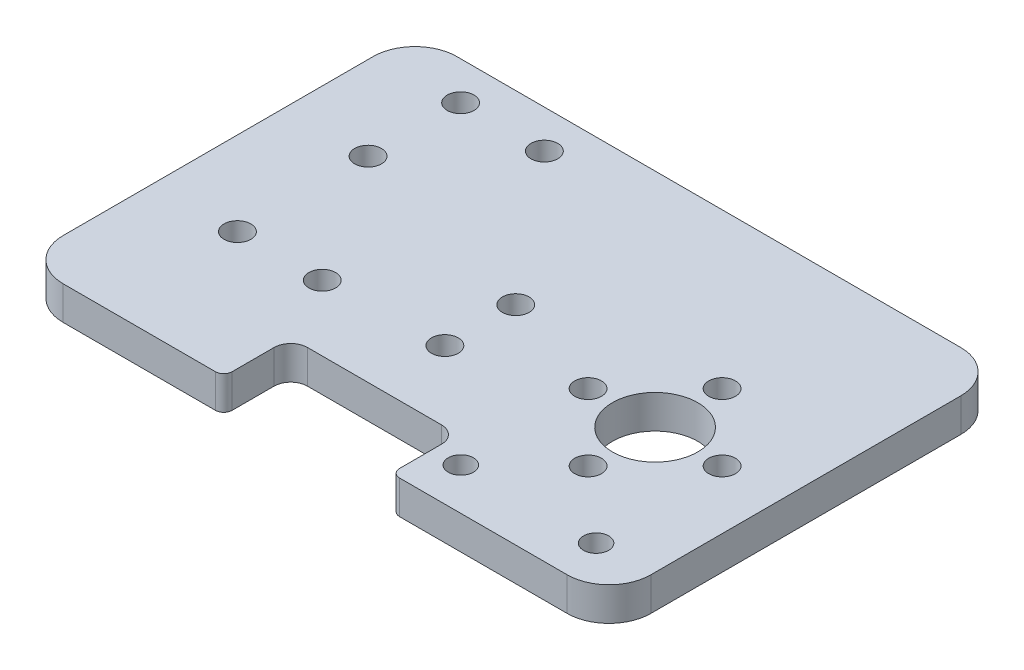
ISO-10303-21;
HEADER;
FILE_DESCRIPTION(('STEP AP214'),'2;1');
FILE_NAME('part.step','',(''),(''),'','','');
FILE_SCHEMA(('AUTOMOTIVE_DESIGN { 1 0 10303 214 1 1 1 1 }'));
ENDSEC;
DATA;
#1=APPLICATION_CONTEXT('core data for automotive mechanical design processes');
#2=APPLICATION_PROTOCOL_DEFINITION('international standard','automotive_design',2000,#1);
#3=PRODUCT_CONTEXT('',#1,'mechanical');
#4=PRODUCT('Part','Part','',(#3));
#5=PRODUCT_RELATED_PRODUCT_CATEGORY('part','',(#4));
#6=PRODUCT_DEFINITION_FORMATION('','',#4);
#7=PRODUCT_DEFINITION_CONTEXT('part definition',#1,'design');
#8=PRODUCT_DEFINITION('design','',#6,#7);
#9=PRODUCT_DEFINITION_SHAPE('','',#8);
#10=(LENGTH_UNIT() NAMED_UNIT(*) SI_UNIT(.MILLI.,.METRE.));
#11=(NAMED_UNIT(*) PLANE_ANGLE_UNIT() SI_UNIT($,.RADIAN.));
#12=(NAMED_UNIT(*) SI_UNIT($,.STERADIAN.) SOLID_ANGLE_UNIT());
#13=UNCERTAINTY_MEASURE_WITH_UNIT(LENGTH_MEASURE(1.E-05),#10,'distance_accuracy_value','');
#14=(GEOMETRIC_REPRESENTATION_CONTEXT(3) GLOBAL_UNCERTAINTY_ASSIGNED_CONTEXT((#13)) GLOBAL_UNIT_ASSIGNED_CONTEXT((#10,
#11,#12)) REPRESENTATION_CONTEXT('',''));
#15=CARTESIAN_POINT('',(0.,0.,0.));
#16=DIRECTION('',(0.,0.,1.));
#17=DIRECTION('',(1.,0.,0.));
#18=AXIS2_PLACEMENT_3D('',#15,#16,#17);
#19=CARTESIAN_POINT('',(69.9999999999753,74.7441308476182,25.5000000046335));
#20=DIRECTION('',(0.,0.,1.));
#21=DIRECTION('',(1.,0.,0.));
#22=AXIS2_PLACEMENT_3D('',#19,#20,#21);
#23=PLANE('',#22);
#24=DIRECTION('',(1.,0.,0.));
#25=VECTOR('',#24,1.);
#26=CARTESIAN_POINT('',(69.9999999999753,4.,25.5000000046335));
#27=LINE('',#26,#25);
#28=CARTESIAN_POINT('',(45.,4.,25.5000000046335));
#29=VERTEX_POINT('',#28);
#30=CARTESIAN_POINT('',(65.,4.,25.5000000046335));
#31=VERTEX_POINT('',#30);
#32=EDGE_CURVE('E252',#29,#31,#27,.T.);
#33=ORIENTED_EDGE('',*,*,#32,.F.);
#34=DIRECTION('',(0.,-1.,0.));
#35=VECTOR('',#34,1.);
#36=CARTESIAN_POINT('',(45.,0.,25.5000000046335));
#37=LINE('',#36,#35);
#38=CARTESIAN_POINT('',(45.,0.,25.5000000046335));
#39=VERTEX_POINT('',#38);
#40=EDGE_CURVE('E339',#29,#39,#37,.T.);
#41=ORIENTED_EDGE('',*,*,#40,.T.);
#42=DIRECTION('',(-1.,0.,0.));
#43=VECTOR('',#42,1.);
#44=CARTESIAN_POINT('',(69.9999999999753,0.,25.5000000046335));
#45=LINE('',#44,#43);
#46=CARTESIAN_POINT('',(65.,0.,25.5000000046335));
#47=VERTEX_POINT('',#46);
#48=EDGE_CURVE('E253',#47,#39,#45,.T.);
#49=ORIENTED_EDGE('',*,*,#48,.F.);
#50=DIRECTION('',(0.,-1.,0.));
#51=VECTOR('',#50,1.);
#52=CARTESIAN_POINT('',(65.,4.,25.5000000046335));
#53=LINE('',#52,#51);
#54=EDGE_CURVE('E320',#47,#31,#53,.F.);
#55=ORIENTED_EDGE('',*,*,#54,.T.);
#56=EDGE_LOOP('',(#33,#41,#49,#55));
#57=FACE_BOUND('',#56,.T.);
#58=ADVANCED_FACE('F34',(#57),#23,.T.);
#59=CARTESIAN_POINT('',(-90.,4.,-21.5));
#60=DIRECTION('',(0.,0.,1.));
#61=DIRECTION('',(1.,0.,0.));
#62=AXIS2_PLACEMENT_3D('',#59,#60,#61);
#63=PLANE('',#62);
#64=DIRECTION('',(-1.,0.,0.));
#65=VECTOR('',#64,1.);
#66=CARTESIAN_POINT('',(-90.,0.,-21.5));
#67=LINE('',#66,#65);
#68=CARTESIAN_POINT('',(64.9999999999999,0.,-21.5));
#69=VERTEX_POINT('',#68);
#70=CARTESIAN_POINT('',(4.83069011810414,0.,-21.5));
#71=VERTEX_POINT('',#70);
#72=EDGE_CURVE('E293',#69,#71,#67,.T.);
#73=ORIENTED_EDGE('',*,*,#72,.T.);
#74=DIRECTION('',(0.,-1.,0.));
#75=VECTOR('',#74,1.);
#76=CARTESIAN_POINT('',(4.83069011810417,4.,-21.5));
#77=LINE('',#76,#75);
#78=CARTESIAN_POINT('',(4.83069011810414,4.,-21.5));
#79=VERTEX_POINT('',#78);
#80=EDGE_CURVE('E315',#71,#79,#77,.F.);
#81=ORIENTED_EDGE('',*,*,#80,.T.);
#82=DIRECTION('',(-1.,0.,0.));
#83=VECTOR('',#82,1.);
#84=CARTESIAN_POINT('',(-90.,4.,-21.5));
#85=LINE('',#84,#83);
#86=CARTESIAN_POINT('',(64.9999999999999,4.,-21.5));
#87=VERTEX_POINT('',#86);
#88=EDGE_CURVE('E296',#87,#79,#85,.T.);
#89=ORIENTED_EDGE('',*,*,#88,.F.);
#90=DIRECTION('',(0.,1.,0.));
#91=VECTOR('',#90,1.);
#92=CARTESIAN_POINT('',(65.,4.,-21.5));
#93=LINE('',#92,#91);
#94=EDGE_CURVE('E308',#87,#69,#93,.F.);
#95=ORIENTED_EDGE('',*,*,#94,.T.);
#96=EDGE_LOOP('',(#73,#81,#89,#95));
#97=FACE_BOUND('',#96,.T.);
#98=ADVANCED_FACE('F390',(#97),#63,.F.);
#99=CARTESIAN_POINT('',(0.,4.,0.));
#100=DIRECTION('',(0.,-1.,0.));
#101=DIRECTION('',(0.,0.,-1.));
#102=AXIS2_PLACEMENT_3D('',#99,#100,#101);
#103=PLANE('',#102);
#104=CARTESIAN_POINT('',(19.9250913739891,4.,9.66419342931644));
#105=DIRECTION('',(0.,1.,0.));
#106=DIRECTION('',(0.,0.,1.));
#107=AXIS2_PLACEMENT_3D('',#104,#105,#106);
#108=CIRCLE('',#107,1.6);
#109=CARTESIAN_POINT('',(19.9250913739891,4.,11.2641934293164));
#110=VERTEX_POINT('',#109);
#111=EDGE_CURVE('E191',#110,#110,#108,.T.);
#112=ORIENTED_EDGE('',*,*,#111,.F.);
#113=EDGE_LOOP('',(#112));
#114=FACE_BOUND('',#113,.T.);
#115=CARTESIAN_POINT('',(19.8306901181041,4.,-16.9489152181335));
#116=DIRECTION('',(0.,-1.,0.));
#117=DIRECTION('',(0.,0.,-1.));
#118=AXIS2_PLACEMENT_3D('',#115,#116,#117);
#119=CIRCLE('',#118,1.6);
#120=CARTESIAN_POINT('',(19.8306901181041,4.,-18.5489152181335));
#121=VERTEX_POINT('',#120);
#122=EDGE_CURVE('E214',#121,#121,#119,.T.);
#123=ORIENTED_EDGE('',*,*,#122,.T.);
#124=EDGE_LOOP('',(#123));
#125=FACE_BOUND('',#124,.T.);
#126=CARTESIAN_POINT('',(9.83069011810414,4.,-16.9489152181335));
#127=DIRECTION('',(0.,-1.,0.));
#128=DIRECTION('',(0.,0.,-1.));
#129=AXIS2_PLACEMENT_3D('',#126,#127,#128);
#130=CIRCLE('',#129,1.6);
#131=CARTESIAN_POINT('',(9.83069011810414,4.,-18.5489152181335));
#132=VERTEX_POINT('',#131);
#133=EDGE_CURVE('E208',#132,#132,#130,.T.);
#134=ORIENTED_EDGE('',*,*,#133,.T.);
#135=EDGE_LOOP('',(#134));
#136=FACE_BOUND('',#135,.T.);
#137=CARTESIAN_POINT('',(9.83069011810414,4.,9.7));
#138=DIRECTION('',(0.,-1.,0.));
#139=DIRECTION('',(0.,0.,-1.));
#140=AXIS2_PLACEMENT_3D('',#137,#138,#139);
#141=CIRCLE('',#140,1.6);
#142=CARTESIAN_POINT('',(9.83069011810414,4.,8.1));
#143=VERTEX_POINT('',#142);
#144=EDGE_CURVE('E201',#143,#143,#141,.T.);
#145=ORIENTED_EDGE('',*,*,#144,.T.);
#146=EDGE_LOOP('',(#145));
#147=FACE_BOUND('',#146,.T.);
#148=CARTESIAN_POINT('',(9.83069011810414,4.,-5.9));
#149=DIRECTION('',(0.,-1.,0.));
#150=DIRECTION('',(0.,0.,-1.));
#151=AXIS2_PLACEMENT_3D('',#148,#149,#150);
#152=CIRCLE('',#151,1.6);
#153=CARTESIAN_POINT('',(9.83069011810414,4.,-7.5));
#154=VERTEX_POINT('',#153);
#155=EDGE_CURVE('E219',#154,#154,#152,.T.);
#156=ORIENTED_EDGE('',*,*,#155,.T.);
#157=EDGE_LOOP('',(#156));
#158=FACE_BOUND('',#157,.T.);
#159=CARTESIAN_POINT('',(33.9999999999993,4.,0.636740590504687));
#160=DIRECTION('',(0.,-1.,0.));
#161=DIRECTION('',(0.,0.,-1.));
#162=AXIS2_PLACEMENT_3D('',#159,#160,#161);
#163=CIRCLE('',#162,1.60000000001061);
#164=CARTESIAN_POINT('',(33.9999999999993,4.,-0.963259409505926));
#165=VERTEX_POINT('',#164);
#166=EDGE_CURVE('E225',#165,#165,#163,.T.);
#167=ORIENTED_EDGE('',*,*,#166,.T.);
#168=EDGE_LOOP('',(#167));
#169=FACE_BOUND('',#168,.T.);
#170=CARTESIAN_POINT('',(33.9999999999817,4.,9.09999999998512));
#171=DIRECTION('',(0.,-1.,0.));
#172=DIRECTION('',(0.,0.,-1.));
#173=AXIS2_PLACEMENT_3D('',#170,#171,#172);
#174=CIRCLE('',#173,1.5999999999967);
#175=CARTESIAN_POINT('',(33.9999999999817,4.,7.49999999998841));
#176=VERTEX_POINT('',#175);
#177=EDGE_CURVE('E232',#176,#176,#174,.T.);
#178=ORIENTED_EDGE('',*,*,#177,.T.);
#179=EDGE_LOOP('',(#178));
#180=FACE_BOUND('',#179,.T.);
#181=CARTESIAN_POINT('',(63.4553938665241,4.,20.4999999999989));
#182=DIRECTION('',(0.,-1.,0.));
#183=DIRECTION('',(0.,0.,-1.));
#184=AXIS2_PLACEMENT_3D('',#181,#182,#183);
#185=CIRCLE('',#184,1.5000000011415);
#186=CARTESIAN_POINT('',(63.4553938665241,4.,18.9999999988574));
#187=VERTEX_POINT('',#186);
#188=EDGE_CURVE('E237',#187,#187,#185,.T.);
#189=ORIENTED_EDGE('',*,*,#188,.T.);
#190=EDGE_LOOP('',(#189));
#191=FACE_BOUND('',#190,.T.);
#192=CARTESIAN_POINT('',(47.3014653528141,4.,20.4999999999993));
#193=DIRECTION('',(0.,-1.,0.));
#194=DIRECTION('',(0.,0.,-1.));
#195=AXIS2_PLACEMENT_3D('',#192,#193,#194);
#196=CIRCLE('',#195,1.50000000438096);
#197=CARTESIAN_POINT('',(47.3014653528141,4.,18.9999999956184));
#198=VERTEX_POINT('',#197);
#199=EDGE_CURVE('E244',#198,#198,#196,.T.);
#200=ORIENTED_EDGE('',*,*,#199,.T.);
#201=EDGE_LOOP('',(#200));
#202=FACE_BOUND('',#201,.T.);
#203=CARTESIAN_POINT('',(63.,4.,5.));
#204=DIRECTION('',(0.,1.,0.));
#205=DIRECTION('',(0.,0.,1.));
#206=AXIS2_PLACEMENT_3D('',#203,#204,#205);
#207=CIRCLE('',#206,1.60000000000001);
#208=CARTESIAN_POINT('',(63.,4.,6.6));
#209=VERTEX_POINT('',#208);
#210=EDGE_CURVE('E282',#209,#209,#207,.T.);
#211=ORIENTED_EDGE('',*,*,#210,.F.);
#212=EDGE_LOOP('',(#211));
#213=FACE_BOUND('',#212,.T.);
#214=CARTESIAN_POINT('',(55.,4.,13.));
#215=DIRECTION('',(0.,1.,0.));
#216=DIRECTION('',(0.,0.,1.));
#217=AXIS2_PLACEMENT_3D('',#214,#215,#216);
#218=CIRCLE('',#217,1.6);
#219=CARTESIAN_POINT('',(55.,4.,14.6));
#220=VERTEX_POINT('',#219);
#221=EDGE_CURVE('E269',#220,#220,#218,.T.);
#222=ORIENTED_EDGE('',*,*,#221,.F.);
#223=EDGE_LOOP('',(#222));
#224=FACE_BOUND('',#223,.T.);
#225=CARTESIAN_POINT('',(47.,4.,5.00000000000001));
#226=DIRECTION('',(0.,1.,0.));
#227=DIRECTION('',(0.,0.,1.));
#228=AXIS2_PLACEMENT_3D('',#225,#226,#227);
#229=CIRCLE('',#228,1.60000000000001);
#230=CARTESIAN_POINT('',(47.,4.,6.60000000000002));
#231=VERTEX_POINT('',#230);
#232=EDGE_CURVE('E270',#231,#231,#229,.T.);
#233=ORIENTED_EDGE('',*,*,#232,.F.);
#234=EDGE_LOOP('',(#233));
#235=FACE_BOUND('',#234,.T.);
#236=CARTESIAN_POINT('',(55.,4.,-3.));
#237=DIRECTION('',(0.,1.,0.));
#238=DIRECTION('',(0.,0.,1.));
#239=AXIS2_PLACEMENT_3D('',#236,#237,#238);
#240=CIRCLE('',#239,1.60000000000001);
#241=CARTESIAN_POINT('',(55.,4.,-1.39999999999999));
#242=VERTEX_POINT('',#241);
#243=EDGE_CURVE('E263',#242,#242,#240,.T.);
#244=ORIENTED_EDGE('',*,*,#243,.F.);
#245=EDGE_LOOP('',(#244));
#246=FACE_BOUND('',#245,.T.);
#247=CARTESIAN_POINT('',(55.,4.,5.));
#248=DIRECTION('',(0.,1.,0.));
#249=DIRECTION('',(0.,0.,1.));
#250=AXIS2_PLACEMENT_3D('',#247,#248,#249);
#251=CIRCLE('',#250,5.1);
#252=CARTESIAN_POINT('',(55.,4.,10.1));
#253=VERTEX_POINT('',#252);
#254=EDGE_CURVE('E281',#253,#253,#251,.T.);
#255=ORIENTED_EDGE('',*,*,#254,.F.);
#256=EDGE_LOOP('',(#255));
#257=FACE_BOUND('',#256,.T.);
#258=DIRECTION('',(0.,0.,1.));
#259=VECTOR('',#258,1.);
#260=CARTESIAN_POINT('',(44.,4.,25.5000000046335));
#261=LINE('',#260,#259);
#262=CARTESIAN_POINT('',(44.,4.,19.5000000046335));
#263=VERTEX_POINT('',#262);
#264=CARTESIAN_POINT('',(44.,4.,24.5000000046335));
#265=VERTEX_POINT('',#264);
#266=EDGE_CURVE('E166',#263,#265,#261,.T.);
#267=ORIENTED_EDGE('',*,*,#266,.T.);
#268=CARTESIAN_POINT('',(45.,4.,24.5000000046335));
#269=DIRECTION('',(0.,-1.,0.));
#270=DIRECTION('',(0.,0.,-1.));
#271=AXIS2_PLACEMENT_3D('',#268,#269,#270);
#272=CIRCLE('',#271,1.);
#273=EDGE_CURVE('E349',#265,#29,#272,.F.);
#274=ORIENTED_EDGE('',*,*,#273,.T.);
#275=ORIENTED_EDGE('',*,*,#32,.T.);
#276=CARTESIAN_POINT('',(65.,4.,20.5000000046335));
#277=DIRECTION('',(0.,-1.,0.));
#278=DIRECTION('',(0.,0.,-1.));
#279=AXIS2_PLACEMENT_3D('',#276,#277,#278);
#280=CIRCLE('',#279,5.);
#281=CARTESIAN_POINT('',(70.,4.,20.5000000046335));
#282=VERTEX_POINT('',#281);
#283=EDGE_CURVE('E332',#31,#282,#280,.F.);
#284=ORIENTED_EDGE('',*,*,#283,.T.);
#285=DIRECTION('',(0.,0.,1.));
#286=VECTOR('',#285,1.);
#287=CARTESIAN_POINT('',(70.,4.,-21.5));
#288=LINE('',#287,#286);
#289=CARTESIAN_POINT('',(70.,4.,-16.5));
#290=VERTEX_POINT('',#289);
#291=EDGE_CURVE('E258',#290,#282,#288,.T.);
#292=ORIENTED_EDGE('',*,*,#291,.F.);
#293=CARTESIAN_POINT('',(65.,4.,-16.5));
#294=DIRECTION('',(0.,-1.,0.));
#295=DIRECTION('',(0.,0.,-1.));
#296=AXIS2_PLACEMENT_3D('',#293,#294,#295);
#297=CIRCLE('',#296,5.);
#298=EDGE_CURVE('E299',#290,#87,#297,.F.);
#299=ORIENTED_EDGE('',*,*,#298,.T.);
#300=ORIENTED_EDGE('',*,*,#88,.T.);
#301=CARTESIAN_POINT('',(4.83069011810417,4.,-16.5));
#302=DIRECTION('',(0.,-1.,0.));
#303=DIRECTION('',(0.,0.,-1.));
#304=AXIS2_PLACEMENT_3D('',#301,#302,#303);
#305=CIRCLE('',#304,5.);
#306=CARTESIAN_POINT('',(-0.16930988189583,4.,-16.5));
#307=VERTEX_POINT('',#306);
#308=EDGE_CURVE('E317',#79,#307,#305,.F.);
#309=ORIENTED_EDGE('',*,*,#308,.T.);
#310=DIRECTION('',(0.,0.,-1.));
#311=VECTOR('',#310,1.);
#312=CARTESIAN_POINT('',(-0.16930988189583,4.,21.5));
#313=LINE('',#312,#311);
#314=CARTESIAN_POINT('',(-0.16930988189583,4.,20.5000000046335));
#315=VERTEX_POINT('',#314);
#316=EDGE_CURVE('E256',#315,#307,#313,.T.);
#317=ORIENTED_EDGE('',*,*,#316,.F.);
#318=CARTESIAN_POINT('',(4.83069011810416,4.,20.5000000046335));
#319=DIRECTION('',(0.,-1.,0.));
#320=DIRECTION('',(0.,0.,-1.));
#321=AXIS2_PLACEMENT_3D('',#318,#319,#320);
#322=CIRCLE('',#321,5.);
#323=CARTESIAN_POINT('',(4.83069011810416,4.,25.5000000046335));
#324=VERTEX_POINT('',#323);
#325=EDGE_CURVE('E334',#315,#324,#322,.F.);
#326=ORIENTED_EDGE('',*,*,#325,.T.);
#327=CARTESIAN_POINT('',(23.,4.,25.5000000046335));
#328=VERTEX_POINT('',#327);
#329=EDGE_CURVE('E249',#324,#328,#27,.T.);
#330=ORIENTED_EDGE('',*,*,#329,.T.);
#331=CARTESIAN_POINT('',(23.,4.,24.5000000046335));
#332=DIRECTION('',(0.,-1.,0.));
#333=DIRECTION('',(0.,0.,-1.));
#334=AXIS2_PLACEMENT_3D('',#331,#332,#333);
#335=CIRCLE('',#334,1.);
#336=CARTESIAN_POINT('',(24.,4.,24.5000000046335));
#337=VERTEX_POINT('',#336);
#338=EDGE_CURVE('E49',#328,#337,#335,.F.);
#339=ORIENTED_EDGE('',*,*,#338,.T.);
#340=DIRECTION('',(0.,0.,-1.));
#341=VECTOR('',#340,1.);
#342=CARTESIAN_POINT('',(24.,4.,19.5000000046335));
#343=LINE('',#342,#341);
#344=CARTESIAN_POINT('',(24.,4.,19.5000000046335));
#345=VERTEX_POINT('',#344);
#346=EDGE_CURVE('E145',#337,#345,#343,.T.);
#347=ORIENTED_EDGE('',*,*,#346,.T.);
#348=CARTESIAN_POINT('',(26.,4.,19.5000000046335));
#349=DIRECTION('',(0.,-1.,0.));
#350=DIRECTION('',(0.,0.,1.));
#351=AXIS2_PLACEMENT_3D('',#348,#349,#350);
#352=CIRCLE('',#351,2.);
#353=CARTESIAN_POINT('',(26.,4.,17.5000000046335));
#354=VERTEX_POINT('',#353);
#355=EDGE_CURVE('E151',#345,#354,#352,.T.);
#356=ORIENTED_EDGE('',*,*,#355,.T.);
#357=DIRECTION('',(1.,0.,0.));
#358=VECTOR('',#357,1.);
#359=CARTESIAN_POINT('',(42.,4.,17.5000000046335));
#360=LINE('',#359,#358);
#361=CARTESIAN_POINT('',(42.,4.,17.5000000046335));
#362=VERTEX_POINT('',#361);
#363=EDGE_CURVE('E170',#354,#362,#360,.T.);
#364=ORIENTED_EDGE('',*,*,#363,.T.);
#365=CARTESIAN_POINT('',(42.,4.,19.5000000046335));
#366=DIRECTION('',(0.,-1.,0.));
#367=DIRECTION('',(0.,0.,1.));
#368=AXIS2_PLACEMENT_3D('',#365,#366,#367);
#369=CIRCLE('',#368,2.);
#370=EDGE_CURVE('E172',#362,#263,#369,.T.);
#371=ORIENTED_EDGE('',*,*,#370,.T.);
#372=EDGE_LOOP('',(#267,#274,#275,#284,#292,#299,#300,#309,#317,#326,#330,#339,#347,#356,#364,#371));
#373=FACE_BOUND('',#372,.T.);
#374=ADVANCED_FACE('F148',(#114,#125,#136,#147,#158,#169,#180,#191,#202,#213,#224,#235,#246,
#257,#373),#103,.F.);
#375=CARTESIAN_POINT('',(0.,0.,0.));
#376=DIRECTION('',(0.,-1.,0.));
#377=DIRECTION('',(0.,0.,-1.));
#378=AXIS2_PLACEMENT_3D('',#375,#376,#377);
#379=PLANE('',#378);
#380=ORIENTED_EDGE('',*,*,#48,.T.);
#381=CARTESIAN_POINT('',(45.,0.,24.5000000046335));
#382=DIRECTION('',(0.,-1.,0.));
#383=DIRECTION('',(0.,0.,-1.));
#384=AXIS2_PLACEMENT_3D('',#381,#382,#383);
#385=CIRCLE('',#384,1.);
#386=CARTESIAN_POINT('',(44.,0.,24.5000000046335));
#387=VERTEX_POINT('',#386);
#388=EDGE_CURVE('E344',#39,#387,#385,.T.);
#389=ORIENTED_EDGE('',*,*,#388,.T.);
#390=DIRECTION('',(0.,0.,1.));
#391=VECTOR('',#390,1.);
#392=CARTESIAN_POINT('',(44.,0.,25.5000000046335));
#393=LINE('',#392,#391);
#394=CARTESIAN_POINT('',(44.,0.,19.5000000046335));
#395=VERTEX_POINT('',#394);
#396=EDGE_CURVE('E155',#395,#387,#393,.T.);
#397=ORIENTED_EDGE('',*,*,#396,.F.);
#398=CARTESIAN_POINT('',(42.,0.,19.5000000046335));
#399=DIRECTION('',(0.,-1.,0.));
#400=DIRECTION('',(0.,0.,1.));
#401=AXIS2_PLACEMENT_3D('',#398,#399,#400);
#402=CIRCLE('',#401,2.);
#403=CARTESIAN_POINT('',(42.,0.,17.5000000046335));
#404=VERTEX_POINT('',#403);
#405=EDGE_CURVE('E184',#404,#395,#402,.T.);
#406=ORIENTED_EDGE('',*,*,#405,.F.);
#407=DIRECTION('',(1.,0.,0.));
#408=VECTOR('',#407,1.);
#409=CARTESIAN_POINT('',(42.,0.,17.5000000046335));
#410=LINE('',#409,#408);
#411=CARTESIAN_POINT('',(26.,0.,17.5000000046335));
#412=VERTEX_POINT('',#411);
#413=EDGE_CURVE('E181',#412,#404,#410,.T.);
#414=ORIENTED_EDGE('',*,*,#413,.F.);
#415=CARTESIAN_POINT('',(26.,0.,19.5000000046335));
#416=DIRECTION('',(0.,-1.,0.));
#417=DIRECTION('',(0.,0.,1.));
#418=AXIS2_PLACEMENT_3D('',#415,#416,#417);
#419=CIRCLE('',#418,2.);
#420=CARTESIAN_POINT('',(24.,0.,19.5000000046335));
#421=VERTEX_POINT('',#420);
#422=EDGE_CURVE('E179',#421,#412,#419,.T.);
#423=ORIENTED_EDGE('',*,*,#422,.F.);
#424=DIRECTION('',(0.,0.,-1.));
#425=VECTOR('',#424,1.);
#426=CARTESIAN_POINT('',(24.,0.,19.5000000046335));
#427=LINE('',#426,#425);
#428=CARTESIAN_POINT('',(24.,0.,24.5000000046335));
#429=VERTEX_POINT('',#428);
#430=EDGE_CURVE('E161',#429,#421,#427,.T.);
#431=ORIENTED_EDGE('',*,*,#430,.F.);
#432=CARTESIAN_POINT('',(23.,0.,24.5000000046335));
#433=DIRECTION('',(0.,-1.,0.));
#434=DIRECTION('',(0.,0.,-1.));
#435=AXIS2_PLACEMENT_3D('',#432,#433,#434);
#436=CIRCLE('',#435,1.);
#437=CARTESIAN_POINT('',(23.,0.,25.5000000046335));
#438=VERTEX_POINT('',#437);
#439=EDGE_CURVE('E342',#429,#438,#436,.T.);
#440=ORIENTED_EDGE('',*,*,#439,.T.);
#441=CARTESIAN_POINT('',(4.83069011810416,0.,25.5000000046335));
#442=VERTEX_POINT('',#441);
#443=EDGE_CURVE('E240',#438,#442,#45,.T.);
#444=ORIENTED_EDGE('',*,*,#443,.T.);
#445=CARTESIAN_POINT('',(4.83069011810416,0.,20.5000000046335));
#446=DIRECTION('',(0.,-1.,0.));
#447=DIRECTION('',(0.,0.,-1.));
#448=AXIS2_PLACEMENT_3D('',#445,#446,#447);
#449=CIRCLE('',#448,5.);
#450=CARTESIAN_POINT('',(-0.16930988189583,0.,20.5000000046335));
#451=VERTEX_POINT('',#450);
#452=EDGE_CURVE('E328',#442,#451,#449,.T.);
#453=ORIENTED_EDGE('',*,*,#452,.T.);
#454=DIRECTION('',(0.,0.,-1.));
#455=VECTOR('',#454,1.);
#456=CARTESIAN_POINT('',(-0.16930988189583,0.,21.5));
#457=LINE('',#456,#455);
#458=CARTESIAN_POINT('',(-0.16930988189583,0.,-16.5));
#459=VERTEX_POINT('',#458);
#460=EDGE_CURVE('E251',#451,#459,#457,.T.);
#461=ORIENTED_EDGE('',*,*,#460,.T.);
#462=CARTESIAN_POINT('',(4.83069011810417,0.,-16.5));
#463=DIRECTION('',(0.,-1.,0.));
#464=DIRECTION('',(0.,0.,-1.));
#465=AXIS2_PLACEMENT_3D('',#462,#463,#464);
#466=CIRCLE('',#465,5.);
#467=EDGE_CURVE('E313',#459,#71,#466,.T.);
#468=ORIENTED_EDGE('',*,*,#467,.T.);
#469=ORIENTED_EDGE('',*,*,#72,.F.);
#470=CARTESIAN_POINT('',(65.,0.,-16.5));
#471=DIRECTION('',(0.,-1.,0.));
#472=DIRECTION('',(0.,0.,-1.));
#473=AXIS2_PLACEMENT_3D('',#470,#471,#472);
#474=CIRCLE('',#473,5.);
#475=CARTESIAN_POINT('',(70.,0.,-16.5));
#476=VERTEX_POINT('',#475);
#477=EDGE_CURVE('E306',#69,#476,#474,.T.);
#478=ORIENTED_EDGE('',*,*,#477,.T.);
#479=DIRECTION('',(0.,0.,1.));
#480=VECTOR('',#479,1.);
#481=CARTESIAN_POINT('',(70.,0.,-21.5));
#482=LINE('',#481,#480);
#483=CARTESIAN_POINT('',(70.,0.,20.5000000046335));
#484=VERTEX_POINT('',#483);
#485=EDGE_CURVE('E260',#476,#484,#482,.T.);
#486=ORIENTED_EDGE('',*,*,#485,.T.);
#487=CARTESIAN_POINT('',(65.,0.,20.5000000046335));
#488=DIRECTION('',(0.,-1.,0.));
#489=DIRECTION('',(0.,0.,-1.));
#490=AXIS2_PLACEMENT_3D('',#487,#488,#489);
#491=CIRCLE('',#490,5.);
#492=EDGE_CURVE('E326',#484,#47,#491,.T.);
#493=ORIENTED_EDGE('',*,*,#492,.T.);
#494=EDGE_LOOP('',(#380,#389,#397,#406,#414,#423,#431,#440,#444,#453,#461,#468,#469,#478,#486,#493));
#495=FACE_BOUND('',#494,.T.);
#496=CARTESIAN_POINT('',(19.9250913739891,0.,9.66419342931644));
#497=DIRECTION('',(0.,1.,0.));
#498=DIRECTION('',(0.,0.,1.));
#499=AXIS2_PLACEMENT_3D('',#496,#497,#498);
#500=CIRCLE('',#499,1.6);
#501=CARTESIAN_POINT('',(19.9250913739891,0.,11.2641934293164));
#502=VERTEX_POINT('',#501);
#503=EDGE_CURVE('E195',#502,#502,#500,.T.);
#504=ORIENTED_EDGE('',*,*,#503,.T.);
#505=EDGE_LOOP('',(#504));
#506=FACE_BOUND('',#505,.T.);
#507=CARTESIAN_POINT('',(19.8306901181041,0.,-16.9489152181335));
#508=DIRECTION('',(0.,-1.,0.));
#509=DIRECTION('',(0.,0.,-1.));
#510=AXIS2_PLACEMENT_3D('',#507,#508,#509);
#511=CIRCLE('',#510,1.6);
#512=CARTESIAN_POINT('',(19.8306901181041,0.,-18.5489152181335));
#513=VERTEX_POINT('',#512);
#514=EDGE_CURVE('E198',#513,#513,#511,.T.);
#515=ORIENTED_EDGE('',*,*,#514,.F.);
#516=EDGE_LOOP('',(#515));
#517=FACE_BOUND('',#516,.T.);
#518=CARTESIAN_POINT('',(9.83069011810414,0.,-16.9489152181335));
#519=DIRECTION('',(0.,-1.,0.));
#520=DIRECTION('',(0.,0.,-1.));
#521=AXIS2_PLACEMENT_3D('',#518,#519,#520);
#522=CIRCLE('',#521,1.6);
#523=CARTESIAN_POINT('',(9.83069011810414,0.,-18.5489152181335));
#524=VERTEX_POINT('',#523);
#525=EDGE_CURVE('E211',#524,#524,#522,.T.);
#526=ORIENTED_EDGE('',*,*,#525,.F.);
#527=EDGE_LOOP('',(#526));
#528=FACE_BOUND('',#527,.T.);
#529=CARTESIAN_POINT('',(9.83069011810414,0.,9.7));
#530=DIRECTION('',(0.,-1.,0.));
#531=DIRECTION('',(0.,0.,-1.));
#532=AXIS2_PLACEMENT_3D('',#529,#530,#531);
#533=CIRCLE('',#532,1.6);
#534=CARTESIAN_POINT('',(9.83069011810414,0.,8.1));
#535=VERTEX_POINT('',#534);
#536=EDGE_CURVE('E205',#535,#535,#533,.T.);
#537=ORIENTED_EDGE('',*,*,#536,.F.);
#538=EDGE_LOOP('',(#537));
#539=FACE_BOUND('',#538,.T.);
#540=CARTESIAN_POINT('',(9.83069011810414,0.,-5.9));
#541=DIRECTION('',(0.,-1.,0.));
#542=DIRECTION('',(0.,0.,-1.));
#543=AXIS2_PLACEMENT_3D('',#540,#541,#542);
#544=CIRCLE('',#543,1.6);
#545=CARTESIAN_POINT('',(9.83069011810414,0.,-7.5));
#546=VERTEX_POINT('',#545);
#547=EDGE_CURVE('E204',#546,#546,#544,.T.);
#548=ORIENTED_EDGE('',*,*,#547,.F.);
#549=EDGE_LOOP('',(#548));
#550=FACE_BOUND('',#549,.T.);
#551=CARTESIAN_POINT('',(33.9999999999993,0.,0.636740590504687));
#552=DIRECTION('',(0.,-1.,0.));
#553=DIRECTION('',(0.,0.,-1.));
#554=AXIS2_PLACEMENT_3D('',#551,#552,#553);
#555=CIRCLE('',#554,1.60000000001061);
#556=CARTESIAN_POINT('',(33.9999999999993,0.,-0.963259409505926));
#557=VERTEX_POINT('',#556);
#558=EDGE_CURVE('E229',#557,#557,#555,.T.);
#559=ORIENTED_EDGE('',*,*,#558,.F.);
#560=EDGE_LOOP('',(#559));
#561=FACE_BOUND('',#560,.T.);
#562=CARTESIAN_POINT('',(33.9999999999817,0.,9.09999999998512));
#563=DIRECTION('',(0.,-1.,0.));
#564=DIRECTION('',(0.,0.,-1.));
#565=AXIS2_PLACEMENT_3D('',#562,#563,#564);
#566=CIRCLE('',#565,1.5999999999967);
#567=CARTESIAN_POINT('',(33.9999999999817,0.,7.49999999998841));
#568=VERTEX_POINT('',#567);
#569=EDGE_CURVE('E222',#568,#568,#566,.T.);
#570=ORIENTED_EDGE('',*,*,#569,.F.);
#571=EDGE_LOOP('',(#570));
#572=FACE_BOUND('',#571,.T.);
#573=CARTESIAN_POINT('',(63.4553938665241,0.,20.4999999999989));
#574=DIRECTION('',(0.,-1.,0.));
#575=DIRECTION('',(0.,0.,-1.));
#576=AXIS2_PLACEMENT_3D('',#573,#574,#575);
#577=CIRCLE('',#576,1.5000000011415);
#578=CARTESIAN_POINT('',(63.4553938665241,0.,18.9999999988574));
#579=VERTEX_POINT('',#578);
#580=EDGE_CURVE('E241',#579,#579,#577,.T.);
#581=ORIENTED_EDGE('',*,*,#580,.F.);
#582=EDGE_LOOP('',(#581));
#583=FACE_BOUND('',#582,.T.);
#584=CARTESIAN_POINT('',(47.3014653528141,0.,20.4999999999993));
#585=DIRECTION('',(0.,-1.,0.));
#586=DIRECTION('',(0.,0.,-1.));
#587=AXIS2_PLACEMENT_3D('',#584,#585,#586);
#588=CIRCLE('',#587,1.50000000438096);
#589=CARTESIAN_POINT('',(47.3014653528141,0.,18.9999999956184));
#590=VERTEX_POINT('',#589);
#591=EDGE_CURVE('E228',#590,#590,#588,.T.);
#592=ORIENTED_EDGE('',*,*,#591,.F.);
#593=EDGE_LOOP('',(#592));
#594=FACE_BOUND('',#593,.T.);
#595=CARTESIAN_POINT('',(63.,0.,5.));
#596=DIRECTION('',(0.,1.,0.));
#597=DIRECTION('',(0.,0.,1.));
#598=AXIS2_PLACEMENT_3D('',#595,#596,#597);
#599=CIRCLE('',#598,1.60000000000001);
#600=CARTESIAN_POINT('',(63.,0.,6.6));
#601=VERTEX_POINT('',#600);
#602=EDGE_CURVE('E278',#601,#601,#599,.T.);
#603=ORIENTED_EDGE('',*,*,#602,.T.);
#604=EDGE_LOOP('',(#603));
#605=FACE_BOUND('',#604,.T.);
#606=CARTESIAN_POINT('',(55.,0.,13.));
#607=DIRECTION('',(0.,1.,0.));
#608=DIRECTION('',(0.,0.,1.));
#609=AXIS2_PLACEMENT_3D('',#606,#607,#608);
#610=CIRCLE('',#609,1.6);
#611=CARTESIAN_POINT('',(55.,0.,14.6));
#612=VERTEX_POINT('',#611);
#613=EDGE_CURVE('E285',#612,#612,#610,.T.);
#614=ORIENTED_EDGE('',*,*,#613,.T.);
#615=EDGE_LOOP('',(#614));
#616=FACE_BOUND('',#615,.T.);
#617=CARTESIAN_POINT('',(47.,0.,5.00000000000001));
#618=DIRECTION('',(0.,1.,0.));
#619=DIRECTION('',(0.,0.,1.));
#620=AXIS2_PLACEMENT_3D('',#617,#618,#619);
#621=CIRCLE('',#620,1.60000000000001);
#622=CARTESIAN_POINT('',(47.,0.,6.60000000000002));
#623=VERTEX_POINT('',#622);
#624=EDGE_CURVE('E266',#623,#623,#621,.T.);
#625=ORIENTED_EDGE('',*,*,#624,.T.);
#626=EDGE_LOOP('',(#625));
#627=FACE_BOUND('',#626,.T.);
#628=CARTESIAN_POINT('',(55.,0.,-3.));
#629=DIRECTION('',(0.,1.,0.));
#630=DIRECTION('',(0.,0.,1.));
#631=AXIS2_PLACEMENT_3D('',#628,#629,#630);
#632=CIRCLE('',#631,1.60000000000001);
#633=CARTESIAN_POINT('',(55.,0.,-1.39999999999999));
#634=VERTEX_POINT('',#633);
#635=EDGE_CURVE('E273',#634,#634,#632,.T.);
#636=ORIENTED_EDGE('',*,*,#635,.T.);
#637=EDGE_LOOP('',(#636));
#638=FACE_BOUND('',#637,.T.);
#639=CARTESIAN_POINT('',(55.,0.,5.));
#640=DIRECTION('',(0.,1.,0.));
#641=DIRECTION('',(0.,0.,1.));
#642=AXIS2_PLACEMENT_3D('',#639,#640,#641);
#643=CIRCLE('',#642,5.1);
#644=CARTESIAN_POINT('',(55.,0.,10.1));
#645=VERTEX_POINT('',#644);
#646=EDGE_CURVE('E290',#645,#645,#643,.T.);
#647=ORIENTED_EDGE('',*,*,#646,.T.);
#648=EDGE_LOOP('',(#647));
#649=FACE_BOUND('',#648,.T.);
#650=ADVANCED_FACE('F352',(#495,#506,#517,#528,#539,#550,#561,#572,#583,#594,#605,#616,#627,
#638,#649),#379,.T.);
#651=CARTESIAN_POINT('',(55.,0.,5.));
#652=DIRECTION('',(0.,1.,0.));
#653=DIRECTION('',(0.,0.,1.));
#654=AXIS2_PLACEMENT_3D('',#651,#652,#653);
#655=CYLINDRICAL_SURFACE('',#654,5.1);
#656=ORIENTED_EDGE('',*,*,#646,.F.);
#657=EDGE_LOOP('',(#656));
#658=FACE_BOUND('',#657,.T.);
#659=ORIENTED_EDGE('',*,*,#254,.T.);
#660=EDGE_LOOP('',(#659));
#661=FACE_BOUND('',#660,.T.);
#662=ADVANCED_FACE('F548',(#658,#661),#655,.F.);
#663=CARTESIAN_POINT('',(55.,0.,-3.));
#664=DIRECTION('',(0.,1.,0.));
#665=DIRECTION('',(0.,0.,1.));
#666=AXIS2_PLACEMENT_3D('',#663,#664,#665);
#667=CYLINDRICAL_SURFACE('',#666,1.60000000000001);
#668=ORIENTED_EDGE('',*,*,#635,.F.);
#669=EDGE_LOOP('',(#668));
#670=FACE_BOUND('',#669,.T.);
#671=ORIENTED_EDGE('',*,*,#243,.T.);
#672=EDGE_LOOP('',(#671));
#673=FACE_BOUND('',#672,.T.);
#674=ADVANCED_FACE('F686',(#670,#673),#667,.F.);
#675=CARTESIAN_POINT('',(47.,0.,5.00000000000001));
#676=DIRECTION('',(0.,1.,0.));
#677=DIRECTION('',(0.,0.,1.));
#678=AXIS2_PLACEMENT_3D('',#675,#676,#677);
#679=CYLINDRICAL_SURFACE('',#678,1.60000000000001);
#680=ORIENTED_EDGE('',*,*,#624,.F.);
#681=EDGE_LOOP('',(#680));
#682=FACE_BOUND('',#681,.T.);
#683=ORIENTED_EDGE('',*,*,#232,.T.);
#684=EDGE_LOOP('',(#683));
#685=FACE_BOUND('',#684,.T.);
#686=ADVANCED_FACE('F676',(#682,#685),#679,.F.);
#687=CARTESIAN_POINT('',(55.,0.,13.));
#688=DIRECTION('',(0.,1.,0.));
#689=DIRECTION('',(0.,0.,1.));
#690=AXIS2_PLACEMENT_3D('',#687,#688,#689);
#691=CYLINDRICAL_SURFACE('',#690,1.6);
#692=ORIENTED_EDGE('',*,*,#613,.F.);
#693=EDGE_LOOP('',(#692));
#694=FACE_BOUND('',#693,.T.);
#695=ORIENTED_EDGE('',*,*,#221,.T.);
#696=EDGE_LOOP('',(#695));
#697=FACE_BOUND('',#696,.T.);
#698=ADVANCED_FACE('F666',(#694,#697),#691,.F.);
#699=CARTESIAN_POINT('',(63.,0.,5.));
#700=DIRECTION('',(0.,1.,0.));
#701=DIRECTION('',(0.,0.,1.));
#702=AXIS2_PLACEMENT_3D('',#699,#700,#701);
#703=CYLINDRICAL_SURFACE('',#702,1.60000000000001);
#704=ORIENTED_EDGE('',*,*,#602,.F.);
#705=EDGE_LOOP('',(#704));
#706=FACE_BOUND('',#705,.T.);
#707=ORIENTED_EDGE('',*,*,#210,.T.);
#708=EDGE_LOOP('',(#707));
#709=FACE_BOUND('',#708,.T.);
#710=ADVANCED_FACE('F637',(#706,#709),#703,.F.);
#711=CARTESIAN_POINT('',(70.,0.,-21.5));
#712=DIRECTION('',(-1.,0.,0.));
#713=DIRECTION('',(0.,0.,1.));
#714=AXIS2_PLACEMENT_3D('',#711,#712,#713);
#715=PLANE('',#714);
#716=ORIENTED_EDGE('',*,*,#291,.T.);
#717=DIRECTION('',(0.,-1.,0.));
#718=VECTOR('',#717,1.);
#719=CARTESIAN_POINT('',(70.,0.,20.5000000046335));
#720=LINE('',#719,#718);
#721=EDGE_CURVE('E336',#282,#484,#720,.T.);
#722=ORIENTED_EDGE('',*,*,#721,.T.);
#723=ORIENTED_EDGE('',*,*,#485,.F.);
#724=DIRECTION('',(0.,1.,0.));
#725=VECTOR('',#724,1.);
#726=CARTESIAN_POINT('',(70.,0.,-16.5));
#727=LINE('',#726,#725);
#728=EDGE_CURVE('E303',#476,#290,#727,.T.);
#729=ORIENTED_EDGE('',*,*,#728,.T.);
#730=EDGE_LOOP('',(#716,#722,#723,#729));
#731=FACE_BOUND('',#730,.T.);
#732=ADVANCED_FACE('F380',(#731),#715,.F.);
#733=CARTESIAN_POINT('',(65.,0.,-16.5));
#734=DIRECTION('',(0.,1.,0.));
#735=DIRECTION('',(0.,0.,1.));
#736=AXIS2_PLACEMENT_3D('',#733,#734,#735);
#737=CYLINDRICAL_SURFACE('',#736,5.);
#738=ORIENTED_EDGE('',*,*,#477,.F.);
#739=ORIENTED_EDGE('',*,*,#94,.F.);
#740=ORIENTED_EDGE('',*,*,#298,.F.);
#741=ORIENTED_EDGE('',*,*,#728,.F.);
#742=EDGE_LOOP('',(#738,#739,#740,#741));
#743=FACE_BOUND('',#742,.T.);
#744=ADVANCED_FACE('F385',(#743),#737,.T.);
#745=CARTESIAN_POINT('',(-0.16930988189583,4.,21.5));
#746=DIRECTION('',(-1.,0.,0.));
#747=DIRECTION('',(0.,0.,1.));
#748=AXIS2_PLACEMENT_3D('',#745,#746,#747);
#749=PLANE('',#748);
#750=ORIENTED_EDGE('',*,*,#460,.F.);
#751=DIRECTION('',(0.,-1.,0.));
#752=VECTOR('',#751,1.);
#753=CARTESIAN_POINT('',(-0.16930988189583,4.,20.5000000046335));
#754=LINE('',#753,#752);
#755=EDGE_CURVE('E330',#451,#315,#754,.F.);
#756=ORIENTED_EDGE('',*,*,#755,.T.);
#757=ORIENTED_EDGE('',*,*,#316,.T.);
#758=DIRECTION('',(0.,-1.,0.));
#759=VECTOR('',#758,1.);
#760=CARTESIAN_POINT('',(-0.16930988189583,0.,-16.5));
#761=LINE('',#760,#759);
#762=EDGE_CURVE('E310',#307,#459,#761,.T.);
#763=ORIENTED_EDGE('',*,*,#762,.T.);
#764=EDGE_LOOP('',(#750,#756,#757,#763));
#765=FACE_BOUND('',#764,.T.);
#766=ADVANCED_FACE('F424',(#765),#749,.T.);
#767=CARTESIAN_POINT('',(4.83069011810417,4.,-16.5));
#768=DIRECTION('',(0.,1.,0.));
#769=DIRECTION('',(0.,0.,1.));
#770=AXIS2_PLACEMENT_3D('',#767,#768,#769);
#771=CYLINDRICAL_SURFACE('',#770,5.);
#772=ORIENTED_EDGE('',*,*,#308,.F.);
#773=ORIENTED_EDGE('',*,*,#80,.F.);
#774=ORIENTED_EDGE('',*,*,#467,.F.);
#775=ORIENTED_EDGE('',*,*,#762,.F.);
#776=EDGE_LOOP('',(#772,#773,#774,#775));
#777=FACE_BOUND('',#776,.T.);
#778=ADVANCED_FACE('F395',(#777),#771,.T.);
#779=ORIENTED_EDGE('',*,*,#443,.F.);
#780=DIRECTION('',(0.,-1.,0.));
#781=VECTOR('',#780,1.);
#782=CARTESIAN_POINT('',(23.,4.,25.5000000046335));
#783=LINE('',#782,#781);
#784=EDGE_CURVE('E11',#438,#328,#783,.F.);
#785=ORIENTED_EDGE('',*,*,#784,.T.);
#786=ORIENTED_EDGE('',*,*,#329,.F.);
#787=DIRECTION('',(0.,-1.,0.));
#788=VECTOR('',#787,1.);
#789=CARTESIAN_POINT('',(4.83069011810416,74.7441308476182,25.5000000046335));
#790=LINE('',#789,#788);
#791=EDGE_CURVE('E323',#324,#442,#790,.T.);
#792=ORIENTED_EDGE('',*,*,#791,.T.);
#793=EDGE_LOOP('',(#779,#785,#786,#792));
#794=FACE_BOUND('',#793,.T.);
#795=ADVANCED_FACE('F405',(#794),#23,.T.);
#796=CARTESIAN_POINT('',(4.83069011810416,74.7441308476182,20.5000000046335));
#797=DIRECTION('',(0.,-1.,0.));
#798=DIRECTION('',(0.,0.,-1.));
#799=AXIS2_PLACEMENT_3D('',#796,#797,#798);
#800=CYLINDRICAL_SURFACE('',#799,5.);
#801=ORIENTED_EDGE('',*,*,#325,.F.);
#802=ORIENTED_EDGE('',*,*,#755,.F.);
#803=ORIENTED_EDGE('',*,*,#452,.F.);
#804=ORIENTED_EDGE('',*,*,#791,.F.);
#805=EDGE_LOOP('',(#801,#802,#803,#804));
#806=FACE_BOUND('',#805,.T.);
#807=ADVANCED_FACE('F403',(#806),#800,.T.);
#808=CARTESIAN_POINT('',(65.,0.,20.5000000046335));
#809=DIRECTION('',(0.,1.,0.));
#810=DIRECTION('',(0.,0.,1.));
#811=AXIS2_PLACEMENT_3D('',#808,#809,#810);
#812=CYLINDRICAL_SURFACE('',#811,5.);
#813=ORIENTED_EDGE('',*,*,#283,.F.);
#814=ORIENTED_EDGE('',*,*,#54,.F.);
#815=ORIENTED_EDGE('',*,*,#492,.F.);
#816=ORIENTED_EDGE('',*,*,#721,.F.);
#817=EDGE_LOOP('',(#813,#814,#815,#816));
#818=FACE_BOUND('',#817,.T.);
#819=ADVANCED_FACE('F377',(#818),#812,.T.);
#820=CARTESIAN_POINT('',(47.3014653528141,4.,20.4999999999993));
#821=DIRECTION('',(0.,-1.,0.));
#822=DIRECTION('',(0.,0.,-1.));
#823=AXIS2_PLACEMENT_3D('',#820,#821,#822);
#824=CYLINDRICAL_SURFACE('',#823,1.50000000438096);
#825=ORIENTED_EDGE('',*,*,#199,.F.);
#826=EDGE_LOOP('',(#825));
#827=FACE_BOUND('',#826,.T.);
#828=ORIENTED_EDGE('',*,*,#591,.T.);
#829=EDGE_LOOP('',(#828));
#830=FACE_BOUND('',#829,.T.);
#831=ADVANCED_FACE('F432',(#827,#830),#824,.F.);
#832=CARTESIAN_POINT('',(63.4553938665241,4.,20.4999999999989));
#833=DIRECTION('',(0.,-1.,0.));
#834=DIRECTION('',(0.,0.,-1.));
#835=AXIS2_PLACEMENT_3D('',#832,#833,#834);
#836=CYLINDRICAL_SURFACE('',#835,1.5000000011415);
#837=ORIENTED_EDGE('',*,*,#188,.F.);
#838=EDGE_LOOP('',(#837));
#839=FACE_BOUND('',#838,.T.);
#840=ORIENTED_EDGE('',*,*,#580,.T.);
#841=EDGE_LOOP('',(#840));
#842=FACE_BOUND('',#841,.T.);
#843=ADVANCED_FACE('F436',(#839,#842),#836,.F.);
#844=CARTESIAN_POINT('',(33.9999999999817,4.,9.09999999998512));
#845=DIRECTION('',(0.,-1.,0.));
#846=DIRECTION('',(0.,0.,-1.));
#847=AXIS2_PLACEMENT_3D('',#844,#845,#846);
#848=CYLINDRICAL_SURFACE('',#847,1.5999999999967);
#849=ORIENTED_EDGE('',*,*,#177,.F.);
#850=EDGE_LOOP('',(#849));
#851=FACE_BOUND('',#850,.T.);
#852=ORIENTED_EDGE('',*,*,#569,.T.);
#853=EDGE_LOOP('',(#852));
#854=FACE_BOUND('',#853,.T.);
#855=ADVANCED_FACE('F441',(#851,#854),#848,.F.);
#856=CARTESIAN_POINT('',(33.9999999999993,4.,0.636740590504687));
#857=DIRECTION('',(0.,-1.,0.));
#858=DIRECTION('',(0.,0.,-1.));
#859=AXIS2_PLACEMENT_3D('',#856,#857,#858);
#860=CYLINDRICAL_SURFACE('',#859,1.60000000001061);
#861=ORIENTED_EDGE('',*,*,#166,.F.);
#862=EDGE_LOOP('',(#861));
#863=FACE_BOUND('',#862,.T.);
#864=ORIENTED_EDGE('',*,*,#558,.T.);
#865=EDGE_LOOP('',(#864));
#866=FACE_BOUND('',#865,.T.);
#867=ADVANCED_FACE('F449',(#863,#866),#860,.F.);
#868=CARTESIAN_POINT('',(9.83069011810414,4.,-5.9));
#869=DIRECTION('',(0.,-1.,0.));
#870=DIRECTION('',(0.,0.,-1.));
#871=AXIS2_PLACEMENT_3D('',#868,#869,#870);
#872=CYLINDRICAL_SURFACE('',#871,1.6);
#873=ORIENTED_EDGE('',*,*,#155,.F.);
#874=EDGE_LOOP('',(#873));
#875=FACE_BOUND('',#874,.T.);
#876=ORIENTED_EDGE('',*,*,#547,.T.);
#877=EDGE_LOOP('',(#876));
#878=FACE_BOUND('',#877,.T.);
#879=ADVANCED_FACE('F453',(#875,#878),#872,.F.);
#880=CARTESIAN_POINT('',(9.83069011810414,4.,9.7));
#881=DIRECTION('',(0.,-1.,0.));
#882=DIRECTION('',(0.,0.,-1.));
#883=AXIS2_PLACEMENT_3D('',#880,#881,#882);
#884=CYLINDRICAL_SURFACE('',#883,1.6);
#885=ORIENTED_EDGE('',*,*,#144,.F.);
#886=EDGE_LOOP('',(#885));
#887=FACE_BOUND('',#886,.T.);
#888=ORIENTED_EDGE('',*,*,#536,.T.);
#889=EDGE_LOOP('',(#888));
#890=FACE_BOUND('',#889,.T.);
#891=ADVANCED_FACE('F457',(#887,#890),#884,.F.);
#892=CARTESIAN_POINT('',(9.83069011810414,4.,-16.9489152181335));
#893=DIRECTION('',(0.,-1.,0.));
#894=DIRECTION('',(0.,0.,-1.));
#895=AXIS2_PLACEMENT_3D('',#892,#893,#894);
#896=CYLINDRICAL_SURFACE('',#895,1.6);
#897=ORIENTED_EDGE('',*,*,#133,.F.);
#898=EDGE_LOOP('',(#897));
#899=FACE_BOUND('',#898,.T.);
#900=ORIENTED_EDGE('',*,*,#525,.T.);
#901=EDGE_LOOP('',(#900));
#902=FACE_BOUND('',#901,.T.);
#903=ADVANCED_FACE('F463',(#899,#902),#896,.F.);
#904=CARTESIAN_POINT('',(19.8306901181041,4.,-16.9489152181335));
#905=DIRECTION('',(0.,-1.,0.));
#906=DIRECTION('',(0.,0.,-1.));
#907=AXIS2_PLACEMENT_3D('',#904,#905,#906);
#908=CYLINDRICAL_SURFACE('',#907,1.6);
#909=ORIENTED_EDGE('',*,*,#122,.F.);
#910=EDGE_LOOP('',(#909));
#911=FACE_BOUND('',#910,.T.);
#912=ORIENTED_EDGE('',*,*,#514,.T.);
#913=EDGE_LOOP('',(#912));
#914=FACE_BOUND('',#913,.T.);
#915=ADVANCED_FACE('F459',(#911,#914),#908,.F.);
#916=CARTESIAN_POINT('',(19.9250913739891,0.,9.66419342931644));
#917=DIRECTION('',(0.,1.,0.));
#918=DIRECTION('',(0.,0.,1.));
#919=AXIS2_PLACEMENT_3D('',#916,#917,#918);
#920=CYLINDRICAL_SURFACE('',#919,1.6);
#921=ORIENTED_EDGE('',*,*,#503,.F.);
#922=EDGE_LOOP('',(#921));
#923=FACE_BOUND('',#922,.T.);
#924=ORIENTED_EDGE('',*,*,#111,.T.);
#925=EDGE_LOOP('',(#924));
#926=FACE_BOUND('',#925,.T.);
#927=ADVANCED_FACE('F462',(#923,#926),#920,.F.);
#928=CARTESIAN_POINT('',(44.,4.,25.5000000046335));
#929=DIRECTION('',(1.,0.,0.));
#930=DIRECTION('',(0.,0.,-1.));
#931=AXIS2_PLACEMENT_3D('',#928,#929,#930);
#932=PLANE('',#931);
#933=ORIENTED_EDGE('',*,*,#396,.T.);
#934=DIRECTION('',(0.,-1.,0.));
#935=VECTOR('',#934,1.);
#936=CARTESIAN_POINT('',(44.,4.,24.5000000046335));
#937=LINE('',#936,#935);
#938=EDGE_CURVE('E346',#387,#265,#937,.F.);
#939=ORIENTED_EDGE('',*,*,#938,.T.);
#940=ORIENTED_EDGE('',*,*,#266,.F.);
#941=DIRECTION('',(0.,-1.,0.));
#942=VECTOR('',#941,1.);
#943=CARTESIAN_POINT('',(44.,4.,19.5000000046335));
#944=LINE('',#943,#942);
#945=EDGE_CURVE('E189',#263,#395,#944,.T.);
#946=ORIENTED_EDGE('',*,*,#945,.T.);
#947=EDGE_LOOP('',(#933,#939,#940,#946));
#948=FACE_BOUND('',#947,.T.);
#949=ADVANCED_FACE('F365',(#948),#932,.F.);
#950=CARTESIAN_POINT('',(42.,4.,19.5000000046335));
#951=DIRECTION('',(0.,-1.,0.));
#952=DIRECTION('',(0.,0.,-1.));
#953=AXIS2_PLACEMENT_3D('',#950,#951,#952);
#954=CYLINDRICAL_SURFACE('',#953,2.);
#955=ORIENTED_EDGE('',*,*,#405,.T.);
#956=ORIENTED_EDGE('',*,*,#945,.F.);
#957=ORIENTED_EDGE('',*,*,#370,.F.);
#958=DIRECTION('',(0.,-1.,0.));
#959=VECTOR('',#958,1.);
#960=CARTESIAN_POINT('',(42.,4.,17.5000000046335));
#961=LINE('',#960,#959);
#962=EDGE_CURVE('E192',#362,#404,#961,.T.);
#963=ORIENTED_EDGE('',*,*,#962,.T.);
#964=EDGE_LOOP('',(#955,#956,#957,#963));
#965=FACE_BOUND('',#964,.T.);
#966=ADVANCED_FACE('F363',(#965),#954,.F.);
#967=CARTESIAN_POINT('',(42.,4.,17.5000000046335));
#968=DIRECTION('',(0.,0.,-1.));
#969=DIRECTION('',(-1.,0.,0.));
#970=AXIS2_PLACEMENT_3D('',#967,#968,#969);
#971=PLANE('',#970);
#972=ORIENTED_EDGE('',*,*,#413,.T.);
#973=ORIENTED_EDGE('',*,*,#962,.F.);
#974=ORIENTED_EDGE('',*,*,#363,.F.);
#975=DIRECTION('',(0.,-1.,0.));
#976=VECTOR('',#975,1.);
#977=CARTESIAN_POINT('',(26.,4.,17.5000000046335));
#978=LINE('',#977,#976);
#979=EDGE_CURVE('E165',#354,#412,#978,.T.);
#980=ORIENTED_EDGE('',*,*,#979,.T.);
#981=EDGE_LOOP('',(#972,#973,#974,#980));
#982=FACE_BOUND('',#981,.T.);
#983=ADVANCED_FACE('F358',(#982),#971,.F.);
#984=CARTESIAN_POINT('',(26.,4.,19.5000000046335));
#985=DIRECTION('',(0.,-1.,0.));
#986=DIRECTION('',(0.,0.,-1.));
#987=AXIS2_PLACEMENT_3D('',#984,#985,#986);
#988=CYLINDRICAL_SURFACE('',#987,2.);
#989=ORIENTED_EDGE('',*,*,#422,.T.);
#990=ORIENTED_EDGE('',*,*,#979,.F.);
#991=ORIENTED_EDGE('',*,*,#355,.F.);
#992=DIRECTION('',(0.,-1.,0.));
#993=VECTOR('',#992,1.);
#994=CARTESIAN_POINT('',(24.,4.,19.5000000046335));
#995=LINE('',#994,#993);
#996=EDGE_CURVE('E158',#345,#421,#995,.T.);
#997=ORIENTED_EDGE('',*,*,#996,.T.);
#998=EDGE_LOOP('',(#989,#990,#991,#997));
#999=FACE_BOUND('',#998,.T.);
#1000=ADVANCED_FACE('F168',(#999),#988,.F.);
#1001=CARTESIAN_POINT('',(24.,4.,19.5000000046335));
#1002=DIRECTION('',(-1.,0.,0.));
#1003=DIRECTION('',(0.,0.,1.));
#1004=AXIS2_PLACEMENT_3D('',#1001,#1002,#1003);
#1005=PLANE('',#1004);
#1006=ORIENTED_EDGE('',*,*,#346,.F.);
#1007=DIRECTION('',(0.,-1.,0.));
#1008=VECTOR('',#1007,1.);
#1009=CARTESIAN_POINT('',(24.,0.,24.5000000046335));
#1010=LINE('',#1009,#1008);
#1011=EDGE_CURVE('E42',#337,#429,#1010,.T.);
#1012=ORIENTED_EDGE('',*,*,#1011,.T.);
#1013=ORIENTED_EDGE('',*,*,#430,.T.);
#1014=ORIENTED_EDGE('',*,*,#996,.F.);
#1015=EDGE_LOOP('',(#1006,#1012,#1013,#1014));
#1016=FACE_BOUND('',#1015,.T.);
#1017=ADVANCED_FACE('F159',(#1016),#1005,.F.);
#1018=CARTESIAN_POINT('',(45.,74.7441308476182,24.5000000046335));
#1019=DIRECTION('',(0.,1.,0.));
#1020=DIRECTION('',(0.,0.,1.));
#1021=AXIS2_PLACEMENT_3D('',#1018,#1019,#1020);
#1022=CYLINDRICAL_SURFACE('',#1021,1.);
#1023=ORIENTED_EDGE('',*,*,#273,.F.);
#1024=ORIENTED_EDGE('',*,*,#938,.F.);
#1025=ORIENTED_EDGE('',*,*,#388,.F.);
#1026=ORIENTED_EDGE('',*,*,#40,.F.);
#1027=EDGE_LOOP('',(#1023,#1024,#1025,#1026));
#1028=FACE_BOUND('',#1027,.T.);
#1029=ADVANCED_FACE('F368',(#1028),#1022,.T.);
#1030=CARTESIAN_POINT('',(23.,4.,24.5000000046335));
#1031=DIRECTION('',(0.,1.,0.));
#1032=DIRECTION('',(0.,0.,1.));
#1033=AXIS2_PLACEMENT_3D('',#1030,#1031,#1032);
#1034=CYLINDRICAL_SURFACE('',#1033,1.);
#1035=ORIENTED_EDGE('',*,*,#338,.F.);
#1036=ORIENTED_EDGE('',*,*,#784,.F.);
#1037=ORIENTED_EDGE('',*,*,#439,.F.);
#1038=ORIENTED_EDGE('',*,*,#1011,.F.);
#1039=EDGE_LOOP('',(#1035,#1036,#1037,#1038));
#1040=FACE_BOUND('',#1039,.T.);
#1041=ADVANCED_FACE('F36',(#1040),#1034,.T.);
#1042=CLOSED_SHELL('',(#58,#98,#374,#650,#662,#674,#686,#698,#710,#732,#744,#766,#778,#795,#807,
#819,#831,#843,#855,#867,#879,#891,#903,#915,#927,#949,#966,#983,#1000,#1017,#1029,#1041));
#1043=MANIFOLD_SOLID_BREP('B2',#1042);
#1044=ADVANCED_BREP_SHAPE_REPRESENTATION('',(#18,#1043),#14);
#1045=SHAPE_DEFINITION_REPRESENTATION(#9,#1044);
ENDSEC;
END-ISO-10303-21;
